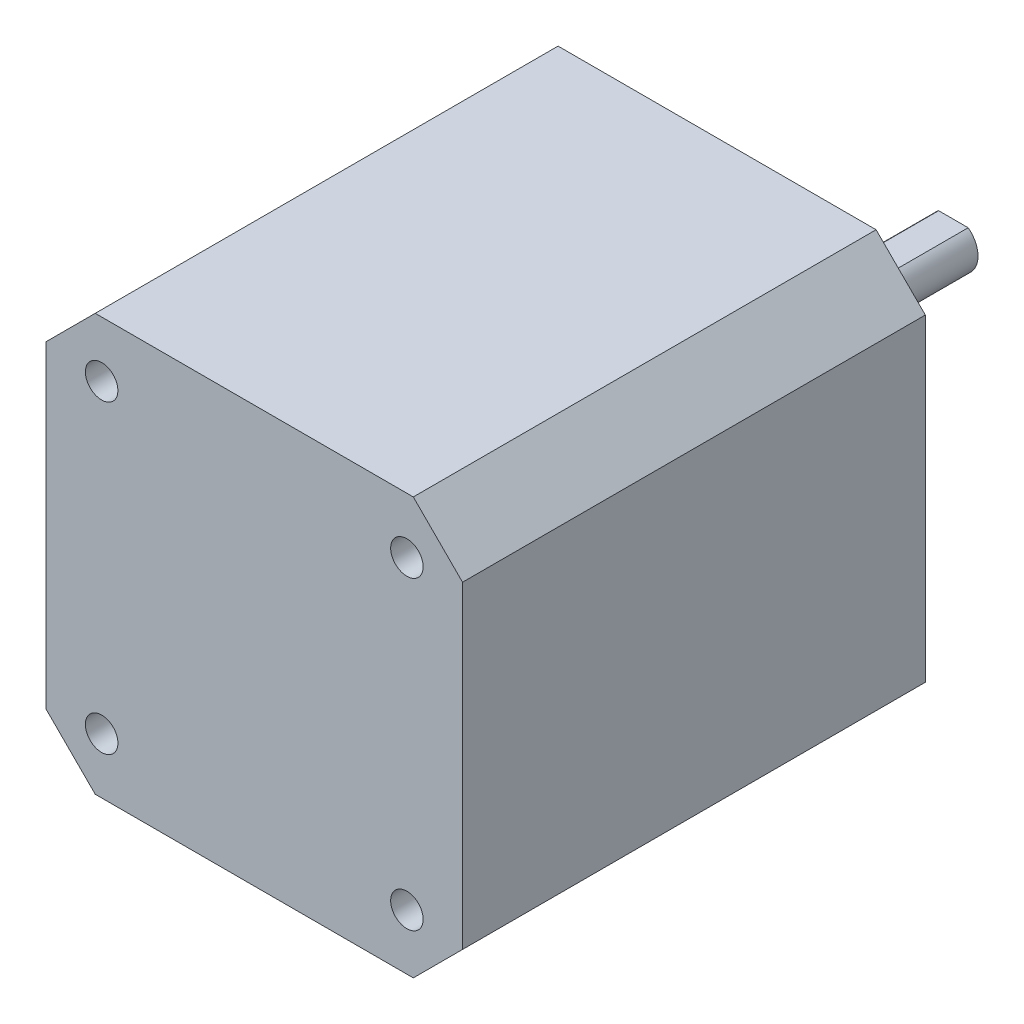
ISO-10303-21;
HEADER;
FILE_DESCRIPTION(('STEP AP214'),'2;1');
FILE_NAME('part.step','',(''),(''),'','','');
FILE_SCHEMA(('AUTOMOTIVE_DESIGN { 1 0 10303 214 1 1 1 1 }'));
ENDSEC;
DATA;
#1=APPLICATION_CONTEXT('core data for automotive mechanical design processes');
#2=APPLICATION_PROTOCOL_DEFINITION('international standard','automotive_design',2000,#1);
#3=PRODUCT_CONTEXT('',#1,'mechanical');
#4=PRODUCT('Part','Part','',(#3));
#5=PRODUCT_RELATED_PRODUCT_CATEGORY('part','',(#4));
#6=PRODUCT_DEFINITION_FORMATION('','',#4);
#7=PRODUCT_DEFINITION_CONTEXT('part definition',#1,'design');
#8=PRODUCT_DEFINITION('design','',#6,#7);
#9=PRODUCT_DEFINITION_SHAPE('','',#8);
#10=(LENGTH_UNIT() NAMED_UNIT(*) SI_UNIT(.MILLI.,.METRE.));
#11=(NAMED_UNIT(*) PLANE_ANGLE_UNIT() SI_UNIT($,.RADIAN.));
#12=(NAMED_UNIT(*) SI_UNIT($,.STERADIAN.) SOLID_ANGLE_UNIT());
#13=UNCERTAINTY_MEASURE_WITH_UNIT(LENGTH_MEASURE(1.E-05),#10,'distance_accuracy_value','');
#14=(GEOMETRIC_REPRESENTATION_CONTEXT(3) GLOBAL_UNCERTAINTY_ASSIGNED_CONTEXT((#13)) GLOBAL_UNIT_ASSIGNED_CONTEXT((#10,
#11,#12)) REPRESENTATION_CONTEXT('',''));
#15=CARTESIAN_POINT('',(0.,0.,0.));
#16=DIRECTION('',(0.,0.,1.));
#17=DIRECTION('',(1.,0.,0.));
#18=AXIS2_PLACEMENT_3D('',#15,#16,#17);
#19=CARTESIAN_POINT('',(0.,0.,-2.));
#20=DIRECTION('',(0.,0.,-1.));
#21=DIRECTION('',(-1.,0.,0.));
#22=AXIS2_PLACEMENT_3D('',#19,#20,#21);
#23=PLANE('',#22);
#24=CARTESIAN_POINT('',(0.,0.,-2.));
#25=DIRECTION('',(0.,0.,-1.));
#26=DIRECTION('',(-1.,0.,0.));
#27=AXIS2_PLACEMENT_3D('',#24,#25,#26);
#28=CIRCLE('',#27,11.);
#29=CARTESIAN_POINT('',(-11.,0.,-2.));
#30=VERTEX_POINT('',#29);
#31=EDGE_CURVE('E216',#30,#30,#28,.T.);
#32=ORIENTED_EDGE('',*,*,#31,.T.);
#33=EDGE_LOOP('',(#32));
#34=FACE_BOUND('',#33,.T.);
#35=DIRECTION('',(1.,0.,0.));
#36=VECTOR('',#35,1.);
#37=CARTESIAN_POINT('',(1.5,2.,-2.));
#38=LINE('',#37,#36);
#39=CARTESIAN_POINT('',(-1.5,2.,-2.));
#40=VERTEX_POINT('',#39);
#41=CARTESIAN_POINT('',(1.5,2.,-2.));
#42=VERTEX_POINT('',#41);
#43=EDGE_CURVE('E229',#40,#42,#38,.T.);
#44=ORIENTED_EDGE('',*,*,#43,.F.);
#45=CARTESIAN_POINT('',(0.,0.,-2.));
#46=DIRECTION('',(0.,0.,-1.));
#47=DIRECTION('',(-1.,0.,0.));
#48=AXIS2_PLACEMENT_3D('',#45,#46,#47);
#49=CIRCLE('',#48,2.5);
#50=EDGE_CURVE('E50',#42,#40,#49,.T.);
#51=ORIENTED_EDGE('',*,*,#50,.F.);
#52=EDGE_LOOP('',(#44,#51));
#53=FACE_BOUND('',#52,.T.);
#54=ADVANCED_FACE('F35',(#34,#53),#23,.T.);
#55=CARTESIAN_POINT('',(0.,0.,47.));
#56=DIRECTION('',(0.,0.,-1.));
#57=DIRECTION('',(-1.,0.,0.));
#58=AXIS2_PLACEMENT_3D('',#55,#56,#57);
#59=PLANE('',#58);
#60=DIRECTION('',(-1.,0.,0.));
#61=VECTOR('',#60,1.);
#62=CARTESIAN_POINT('',(-16.15,21.15,47.));
#63=LINE('',#62,#61);
#64=CARTESIAN_POINT('',(16.15,21.15,47.));
#65=VERTEX_POINT('',#64);
#66=CARTESIAN_POINT('',(-16.15,21.15,47.));
#67=VERTEX_POINT('',#66);
#68=EDGE_CURVE('E161',#65,#67,#63,.T.);
#69=ORIENTED_EDGE('',*,*,#68,.T.);
#70=DIRECTION('',(-0.707106781186548,-0.707106781186548,0.));
#71=VECTOR('',#70,1.);
#72=CARTESIAN_POINT('',(-21.15,16.15,47.));
#73=LINE('',#72,#71);
#74=CARTESIAN_POINT('',(-21.15,16.15,47.));
#75=VERTEX_POINT('',#74);
#76=EDGE_CURVE('E100',#67,#75,#73,.T.);
#77=ORIENTED_EDGE('',*,*,#76,.T.);
#78=DIRECTION('',(0.,-1.,0.));
#79=VECTOR('',#78,1.);
#80=CARTESIAN_POINT('',(-21.15,16.15,47.));
#81=LINE('',#80,#79);
#82=CARTESIAN_POINT('',(-21.15,-16.15,47.));
#83=VERTEX_POINT('',#82);
#84=EDGE_CURVE('E176',#75,#83,#81,.T.);
#85=ORIENTED_EDGE('',*,*,#84,.T.);
#86=DIRECTION('',(0.707106781186548,-0.707106781186548,0.));
#87=VECTOR('',#86,1.);
#88=CARTESIAN_POINT('',(-21.15,-16.15,47.));
#89=LINE('',#88,#87);
#90=CARTESIAN_POINT('',(-16.15,-21.15,47.));
#91=VERTEX_POINT('',#90);
#92=EDGE_CURVE('E189',#83,#91,#89,.T.);
#93=ORIENTED_EDGE('',*,*,#92,.T.);
#94=DIRECTION('',(1.,0.,0.));
#95=VECTOR('',#94,1.);
#96=CARTESIAN_POINT('',(-16.15,-21.15,47.));
#97=LINE('',#96,#95);
#98=CARTESIAN_POINT('',(16.15,-21.15,47.));
#99=VERTEX_POINT('',#98);
#100=EDGE_CURVE('E124',#91,#99,#97,.T.);
#101=ORIENTED_EDGE('',*,*,#100,.T.);
#102=DIRECTION('',(0.707106781186548,0.707106781186548,0.));
#103=VECTOR('',#102,1.);
#104=CARTESIAN_POINT('',(16.15,-21.15,47.));
#105=LINE('',#104,#103);
#106=CARTESIAN_POINT('',(21.15,-16.15,47.));
#107=VERTEX_POINT('',#106);
#108=EDGE_CURVE('E116',#99,#107,#105,.T.);
#109=ORIENTED_EDGE('',*,*,#108,.T.);
#110=DIRECTION('',(0.,1.,0.));
#111=VECTOR('',#110,1.);
#112=CARTESIAN_POINT('',(21.15,16.15,47.));
#113=LINE('',#112,#111);
#114=CARTESIAN_POINT('',(21.15,16.15,47.));
#115=VERTEX_POINT('',#114);
#116=EDGE_CURVE('E121',#107,#115,#113,.T.);
#117=ORIENTED_EDGE('',*,*,#116,.T.);
#118=DIRECTION('',(-0.707106781186548,0.707106781186548,0.));
#119=VECTOR('',#118,1.);
#120=CARTESIAN_POINT('',(16.15,21.15,47.));
#121=LINE('',#120,#119);
#122=EDGE_CURVE('E59',#115,#65,#121,.T.);
#123=ORIENTED_EDGE('',*,*,#122,.T.);
#124=EDGE_LOOP('',(#69,#77,#85,#93,#101,#109,#117,#123));
#125=FACE_BOUND('',#124,.T.);
#126=CARTESIAN_POINT('',(15.5,15.5,47.));
#127=DIRECTION('',(0.,0.,1.));
#128=DIRECTION('',(1.,0.,0.));
#129=AXIS2_PLACEMENT_3D('',#126,#127,#128);
#130=CIRCLE('',#129,1.65);
#131=CARTESIAN_POINT('',(17.15,15.5,47.));
#132=VERTEX_POINT('',#131);
#133=EDGE_CURVE('E149',#132,#132,#130,.T.);
#134=ORIENTED_EDGE('',*,*,#133,.F.);
#135=EDGE_LOOP('',(#134));
#136=FACE_BOUND('',#135,.T.);
#137=CARTESIAN_POINT('',(-15.5,15.5,47.));
#138=DIRECTION('',(0.,0.,1.));
#139=DIRECTION('',(-1.,0.,0.));
#140=AXIS2_PLACEMENT_3D('',#137,#138,#139);
#141=CIRCLE('',#140,1.65);
#142=CARTESIAN_POINT('',(-17.15,15.5,47.));
#143=VERTEX_POINT('',#142);
#144=EDGE_CURVE('E198',#143,#143,#141,.T.);
#145=ORIENTED_EDGE('',*,*,#144,.F.);
#146=EDGE_LOOP('',(#145));
#147=FACE_BOUND('',#146,.T.);
#148=CARTESIAN_POINT('',(15.5,-15.5,47.));
#149=DIRECTION('',(0.,0.,1.));
#150=DIRECTION('',(-1.,0.,0.));
#151=AXIS2_PLACEMENT_3D('',#148,#149,#150);
#152=CIRCLE('',#151,1.65);
#153=CARTESIAN_POINT('',(13.85,-15.5,47.));
#154=VERTEX_POINT('',#153);
#155=EDGE_CURVE('E204',#154,#154,#152,.T.);
#156=ORIENTED_EDGE('',*,*,#155,.F.);
#157=EDGE_LOOP('',(#156));
#158=FACE_BOUND('',#157,.T.);
#159=CARTESIAN_POINT('',(-15.5,-15.5,47.));
#160=DIRECTION('',(0.,0.,1.));
#161=DIRECTION('',(1.,0.,0.));
#162=AXIS2_PLACEMENT_3D('',#159,#160,#161);
#163=CIRCLE('',#162,1.65);
#164=CARTESIAN_POINT('',(-13.85,-15.5,47.));
#165=VERTEX_POINT('',#164);
#166=EDGE_CURVE('E210',#165,#165,#163,.T.);
#167=ORIENTED_EDGE('',*,*,#166,.F.);
#168=EDGE_LOOP('',(#167));
#169=FACE_BOUND('',#168,.T.);
#170=ADVANCED_FACE('F118',(#125,#136,#147,#158,#169),#59,.F.);
#171=CARTESIAN_POINT('',(0.,0.,0.));
#172=DIRECTION('',(0.,0.,-1.));
#173=DIRECTION('',(-1.,0.,0.));
#174=AXIS2_PLACEMENT_3D('',#171,#172,#173);
#175=PLANE('',#174);
#176=CARTESIAN_POINT('',(0.,0.,0.));
#177=DIRECTION('',(0.,0.,-1.));
#178=DIRECTION('',(-1.,0.,0.));
#179=AXIS2_PLACEMENT_3D('',#176,#177,#178);
#180=CIRCLE('',#179,11.);
#181=CARTESIAN_POINT('',(-11.,0.,0.));
#182=VERTEX_POINT('',#181);
#183=EDGE_CURVE('E219',#182,#182,#180,.T.);
#184=ORIENTED_EDGE('',*,*,#183,.F.);
#185=EDGE_LOOP('',(#184));
#186=FACE_BOUND('',#185,.T.);
#187=CARTESIAN_POINT('',(15.5,-15.5,0.));
#188=DIRECTION('',(0.,0.,1.));
#189=DIRECTION('',(-1.,0.,0.));
#190=AXIS2_PLACEMENT_3D('',#187,#188,#189);
#191=CIRCLE('',#190,1.65);
#192=CARTESIAN_POINT('',(13.85,-15.5,0.));
#193=VERTEX_POINT('',#192);
#194=EDGE_CURVE('E207',#193,#193,#191,.T.);
#195=ORIENTED_EDGE('',*,*,#194,.T.);
#196=EDGE_LOOP('',(#195));
#197=FACE_BOUND('',#196,.T.);
#198=CARTESIAN_POINT('',(15.5,15.5,0.));
#199=DIRECTION('',(0.,0.,1.));
#200=DIRECTION('',(1.,0.,0.));
#201=AXIS2_PLACEMENT_3D('',#198,#199,#200);
#202=CIRCLE('',#201,1.65);
#203=CARTESIAN_POINT('',(17.15,15.5,0.));
#204=VERTEX_POINT('',#203);
#205=EDGE_CURVE('E195',#204,#204,#202,.T.);
#206=ORIENTED_EDGE('',*,*,#205,.T.);
#207=EDGE_LOOP('',(#206));
#208=FACE_BOUND('',#207,.T.);
#209=DIRECTION('',(-1.,0.,0.));
#210=VECTOR('',#209,1.);
#211=CARTESIAN_POINT('',(-16.15,21.15,0.));
#212=LINE('',#211,#210);
#213=CARTESIAN_POINT('',(16.15,21.15,0.));
#214=VERTEX_POINT('',#213);
#215=CARTESIAN_POINT('',(-16.15,21.15,0.));
#216=VERTEX_POINT('',#215);
#217=EDGE_CURVE('E145',#214,#216,#212,.T.);
#218=ORIENTED_EDGE('',*,*,#217,.F.);
#219=DIRECTION('',(-0.707106781186548,0.707106781186548,0.));
#220=VECTOR('',#219,1.);
#221=CARTESIAN_POINT('',(16.15,21.15,0.));
#222=LINE('',#221,#220);
#223=CARTESIAN_POINT('',(21.15,16.15,0.));
#224=VERTEX_POINT('',#223);
#225=EDGE_CURVE('E92',#224,#214,#222,.T.);
#226=ORIENTED_EDGE('',*,*,#225,.F.);
#227=DIRECTION('',(0.,1.,0.));
#228=VECTOR('',#227,1.);
#229=CARTESIAN_POINT('',(21.15,16.15,0.));
#230=LINE('',#229,#228);
#231=CARTESIAN_POINT('',(21.15,-16.15,0.));
#232=VERTEX_POINT('',#231);
#233=EDGE_CURVE('E158',#232,#224,#230,.T.);
#234=ORIENTED_EDGE('',*,*,#233,.F.);
#235=DIRECTION('',(0.707106781186548,0.707106781186548,0.));
#236=VECTOR('',#235,1.);
#237=CARTESIAN_POINT('',(16.15,-21.15,0.));
#238=LINE('',#237,#236);
#239=CARTESIAN_POINT('',(16.15,-21.15,0.));
#240=VERTEX_POINT('',#239);
#241=EDGE_CURVE('E133',#240,#232,#238,.T.);
#242=ORIENTED_EDGE('',*,*,#241,.F.);
#243=DIRECTION('',(1.,0.,0.));
#244=VECTOR('',#243,1.);
#245=CARTESIAN_POINT('',(-16.15,-21.15,0.));
#246=LINE('',#245,#244);
#247=CARTESIAN_POINT('',(-16.15,-21.15,0.));
#248=VERTEX_POINT('',#247);
#249=EDGE_CURVE('E155',#248,#240,#246,.T.);
#250=ORIENTED_EDGE('',*,*,#249,.F.);
#251=DIRECTION('',(0.707106781186548,-0.707106781186548,0.));
#252=VECTOR('',#251,1.);
#253=CARTESIAN_POINT('',(-21.15,-16.15,0.));
#254=LINE('',#253,#252);
#255=CARTESIAN_POINT('',(-21.15,-16.15,0.));
#256=VERTEX_POINT('',#255);
#257=EDGE_CURVE('E153',#256,#248,#254,.T.);
#258=ORIENTED_EDGE('',*,*,#257,.F.);
#259=DIRECTION('',(0.,-1.,0.));
#260=VECTOR('',#259,1.);
#261=CARTESIAN_POINT('',(-21.15,16.15,0.));
#262=LINE('',#261,#260);
#263=CARTESIAN_POINT('',(-21.15,16.15,0.));
#264=VERTEX_POINT('',#263);
#265=EDGE_CURVE('E151',#264,#256,#262,.T.);
#266=ORIENTED_EDGE('',*,*,#265,.F.);
#267=DIRECTION('',(-0.707106781186548,-0.707106781186548,0.));
#268=VECTOR('',#267,1.);
#269=CARTESIAN_POINT('',(-21.15,16.15,0.));
#270=LINE('',#269,#268);
#271=EDGE_CURVE('E148',#216,#264,#270,.T.);
#272=ORIENTED_EDGE('',*,*,#271,.F.);
#273=EDGE_LOOP('',(#218,#226,#234,#242,#250,#258,#266,#272));
#274=FACE_BOUND('',#273,.T.);
#275=CARTESIAN_POINT('',(-15.5,15.5,0.));
#276=DIRECTION('',(0.,0.,1.));
#277=DIRECTION('',(-1.,0.,0.));
#278=AXIS2_PLACEMENT_3D('',#275,#276,#277);
#279=CIRCLE('',#278,1.65);
#280=CARTESIAN_POINT('',(-17.15,15.5,0.));
#281=VERTEX_POINT('',#280);
#282=EDGE_CURVE('E201',#281,#281,#279,.T.);
#283=ORIENTED_EDGE('',*,*,#282,.T.);
#284=EDGE_LOOP('',(#283));
#285=FACE_BOUND('',#284,.T.);
#286=CARTESIAN_POINT('',(-15.5,-15.5,0.));
#287=DIRECTION('',(0.,0.,1.));
#288=DIRECTION('',(1.,0.,0.));
#289=AXIS2_PLACEMENT_3D('',#286,#287,#288);
#290=CIRCLE('',#289,1.65);
#291=CARTESIAN_POINT('',(-13.85,-15.5,0.));
#292=VERTEX_POINT('',#291);
#293=EDGE_CURVE('E213',#292,#292,#290,.T.);
#294=ORIENTED_EDGE('',*,*,#293,.T.);
#295=EDGE_LOOP('',(#294));
#296=FACE_BOUND('',#295,.T.);
#297=ADVANCED_FACE('F180',(#186,#197,#208,#274,#285,#296),#175,.T.);
#298=CARTESIAN_POINT('',(-16.15,21.15,47.));
#299=DIRECTION('',(0.,-1.,0.));
#300=DIRECTION('',(0.,0.,-1.));
#301=AXIS2_PLACEMENT_3D('',#298,#299,#300);
#302=PLANE('',#301);
#303=ORIENTED_EDGE('',*,*,#217,.T.);
#304=DIRECTION('',(0.,0.,-1.));
#305=VECTOR('',#304,1.);
#306=CARTESIAN_POINT('',(-16.15,21.15,47.));
#307=LINE('',#306,#305);
#308=EDGE_CURVE('E11',#67,#216,#307,.T.);
#309=ORIENTED_EDGE('',*,*,#308,.F.);
#310=ORIENTED_EDGE('',*,*,#68,.F.);
#311=DIRECTION('',(0.,0.,-1.));
#312=VECTOR('',#311,1.);
#313=CARTESIAN_POINT('',(16.15,21.15,47.));
#314=LINE('',#313,#312);
#315=EDGE_CURVE('E141',#65,#214,#314,.T.);
#316=ORIENTED_EDGE('',*,*,#315,.T.);
#317=EDGE_LOOP('',(#303,#309,#310,#316));
#318=FACE_BOUND('',#317,.T.);
#319=ADVANCED_FACE('F37',(#318),#302,.F.);
#320=CARTESIAN_POINT('',(-21.15,16.15,47.));
#321=DIRECTION('',(0.707106781186547,-0.707106781186547,0.));
#322=DIRECTION('',(0.707106781186548,0.707106781186548,0.));
#323=AXIS2_PLACEMENT_3D('',#320,#321,#322);
#324=PLANE('',#323);
#325=ORIENTED_EDGE('',*,*,#271,.T.);
#326=DIRECTION('',(0.,0.,-1.));
#327=VECTOR('',#326,1.);
#328=CARTESIAN_POINT('',(-21.15,16.15,47.));
#329=LINE('',#328,#327);
#330=EDGE_CURVE('E43',#75,#264,#329,.T.);
#331=ORIENTED_EDGE('',*,*,#330,.F.);
#332=ORIENTED_EDGE('',*,*,#76,.F.);
#333=ORIENTED_EDGE('',*,*,#308,.T.);
#334=EDGE_LOOP('',(#325,#331,#332,#333));
#335=FACE_BOUND('',#334,.T.);
#336=ADVANCED_FACE('F294',(#335),#324,.F.);
#337=CARTESIAN_POINT('',(-21.15,16.15,47.));
#338=DIRECTION('',(1.,0.,0.));
#339=DIRECTION('',(0.,0.,-1.));
#340=AXIS2_PLACEMENT_3D('',#337,#338,#339);
#341=PLANE('',#340);
#342=ORIENTED_EDGE('',*,*,#265,.T.);
#343=DIRECTION('',(0.,0.,-1.));
#344=VECTOR('',#343,1.);
#345=CARTESIAN_POINT('',(-21.15,-16.15,47.));
#346=LINE('',#345,#344);
#347=EDGE_CURVE('E168',#83,#256,#346,.T.);
#348=ORIENTED_EDGE('',*,*,#347,.F.);
#349=ORIENTED_EDGE('',*,*,#84,.F.);
#350=ORIENTED_EDGE('',*,*,#330,.T.);
#351=EDGE_LOOP('',(#342,#348,#349,#350));
#352=FACE_BOUND('',#351,.T.);
#353=ADVANCED_FACE('F174',(#352),#341,.F.);
#354=CARTESIAN_POINT('',(-21.15,-16.15,47.));
#355=DIRECTION('',(0.707106781186547,0.707106781186547,0.));
#356=DIRECTION('',(-0.707106781186548,0.707106781186548,0.));
#357=AXIS2_PLACEMENT_3D('',#354,#355,#356);
#358=PLANE('',#357);
#359=ORIENTED_EDGE('',*,*,#257,.T.);
#360=DIRECTION('',(0.,0.,-1.));
#361=VECTOR('',#360,1.);
#362=CARTESIAN_POINT('',(-16.15,-21.15,47.));
#363=LINE('',#362,#361);
#364=EDGE_CURVE('E165',#91,#248,#363,.T.);
#365=ORIENTED_EDGE('',*,*,#364,.F.);
#366=ORIENTED_EDGE('',*,*,#92,.F.);
#367=ORIENTED_EDGE('',*,*,#347,.T.);
#368=EDGE_LOOP('',(#359,#365,#366,#367));
#369=FACE_BOUND('',#368,.T.);
#370=ADVANCED_FACE('F185',(#369),#358,.F.);
#371=CARTESIAN_POINT('',(-16.15,-21.15,47.));
#372=DIRECTION('',(0.,1.,0.));
#373=DIRECTION('',(0.,0.,1.));
#374=AXIS2_PLACEMENT_3D('',#371,#372,#373);
#375=PLANE('',#374);
#376=ORIENTED_EDGE('',*,*,#249,.T.);
#377=DIRECTION('',(0.,0.,-1.));
#378=VECTOR('',#377,1.);
#379=CARTESIAN_POINT('',(16.15,-21.15,47.));
#380=LINE('',#379,#378);
#381=EDGE_CURVE('E136',#99,#240,#380,.T.);
#382=ORIENTED_EDGE('',*,*,#381,.F.);
#383=ORIENTED_EDGE('',*,*,#100,.F.);
#384=ORIENTED_EDGE('',*,*,#364,.T.);
#385=EDGE_LOOP('',(#376,#382,#383,#384));
#386=FACE_BOUND('',#385,.T.);
#387=ADVANCED_FACE('F188',(#386),#375,.F.);
#388=CARTESIAN_POINT('',(16.15,-21.15,47.));
#389=DIRECTION('',(-0.707106781186547,0.707106781186547,0.));
#390=DIRECTION('',(-0.707106781186548,-0.707106781186548,0.));
#391=AXIS2_PLACEMENT_3D('',#388,#389,#390);
#392=PLANE('',#391);
#393=ORIENTED_EDGE('',*,*,#241,.T.);
#394=DIRECTION('',(0.,0.,-1.));
#395=VECTOR('',#394,1.);
#396=CARTESIAN_POINT('',(21.15,-16.15,47.));
#397=LINE('',#396,#395);
#398=EDGE_CURVE('E130',#107,#232,#397,.T.);
#399=ORIENTED_EDGE('',*,*,#398,.F.);
#400=ORIENTED_EDGE('',*,*,#108,.F.);
#401=ORIENTED_EDGE('',*,*,#381,.T.);
#402=EDGE_LOOP('',(#393,#399,#400,#401));
#403=FACE_BOUND('',#402,.T.);
#404=ADVANCED_FACE('F131',(#403),#392,.F.);
#405=CARTESIAN_POINT('',(21.15,16.15,47.));
#406=DIRECTION('',(-1.,0.,0.));
#407=DIRECTION('',(0.,-1.,0.));
#408=AXIS2_PLACEMENT_3D('',#405,#406,#407);
#409=PLANE('',#408);
#410=ORIENTED_EDGE('',*,*,#233,.T.);
#411=DIRECTION('',(0.,0.,-1.));
#412=VECTOR('',#411,1.);
#413=CARTESIAN_POINT('',(21.15,16.15,47.));
#414=LINE('',#413,#412);
#415=EDGE_CURVE('E137',#115,#224,#414,.T.);
#416=ORIENTED_EDGE('',*,*,#415,.F.);
#417=ORIENTED_EDGE('',*,*,#116,.F.);
#418=ORIENTED_EDGE('',*,*,#398,.T.);
#419=EDGE_LOOP('',(#410,#416,#417,#418));
#420=FACE_BOUND('',#419,.T.);
#421=ADVANCED_FACE('F139',(#420),#409,.F.);
#422=CARTESIAN_POINT('',(16.15,21.15,47.));
#423=DIRECTION('',(-0.707106781186547,-0.707106781186547,0.));
#424=DIRECTION('',(0.707106781186548,-0.707106781186548,0.));
#425=AXIS2_PLACEMENT_3D('',#422,#423,#424);
#426=PLANE('',#425);
#427=ORIENTED_EDGE('',*,*,#225,.T.);
#428=ORIENTED_EDGE('',*,*,#315,.F.);
#429=ORIENTED_EDGE('',*,*,#122,.F.);
#430=ORIENTED_EDGE('',*,*,#415,.T.);
#431=EDGE_LOOP('',(#427,#428,#429,#430));
#432=FACE_BOUND('',#431,.T.);
#433=ADVANCED_FACE('F277',(#432),#426,.F.);
#434=CARTESIAN_POINT('',(15.5,15.5,47.));
#435=DIRECTION('',(0.,0.,-1.));
#436=DIRECTION('',(-1.,0.,0.));
#437=AXIS2_PLACEMENT_3D('',#434,#435,#436);
#438=CYLINDRICAL_SURFACE('',#437,1.65);
#439=ORIENTED_EDGE('',*,*,#133,.T.);
#440=EDGE_LOOP('',(#439));
#441=FACE_BOUND('',#440,.T.);
#442=ORIENTED_EDGE('',*,*,#205,.F.);
#443=EDGE_LOOP('',(#442));
#444=FACE_BOUND('',#443,.T.);
#445=ADVANCED_FACE('F274',(#441,#444),#438,.F.);
#446=CARTESIAN_POINT('',(-15.5,15.5,47.));
#447=DIRECTION('',(0.,0.,-1.));
#448=DIRECTION('',(-1.,0.,0.));
#449=AXIS2_PLACEMENT_3D('',#446,#447,#448);
#450=CYLINDRICAL_SURFACE('',#449,1.65);
#451=ORIENTED_EDGE('',*,*,#144,.T.);
#452=EDGE_LOOP('',(#451));
#453=FACE_BOUND('',#452,.T.);
#454=ORIENTED_EDGE('',*,*,#282,.F.);
#455=EDGE_LOOP('',(#454));
#456=FACE_BOUND('',#455,.T.);
#457=ADVANCED_FACE('F270',(#453,#456),#450,.F.);
#458=CARTESIAN_POINT('',(15.5,-15.5,47.));
#459=DIRECTION('',(0.,0.,-1.));
#460=DIRECTION('',(-1.,0.,0.));
#461=AXIS2_PLACEMENT_3D('',#458,#459,#460);
#462=CYLINDRICAL_SURFACE('',#461,1.65);
#463=ORIENTED_EDGE('',*,*,#155,.T.);
#464=EDGE_LOOP('',(#463));
#465=FACE_BOUND('',#464,.T.);
#466=ORIENTED_EDGE('',*,*,#194,.F.);
#467=EDGE_LOOP('',(#466));
#468=FACE_BOUND('',#467,.T.);
#469=ADVANCED_FACE('F266',(#465,#468),#462,.F.);
#470=CARTESIAN_POINT('',(-15.5,-15.5,47.));
#471=DIRECTION('',(0.,0.,-1.));
#472=DIRECTION('',(-1.,0.,0.));
#473=AXIS2_PLACEMENT_3D('',#470,#471,#472);
#474=CYLINDRICAL_SURFACE('',#473,1.65);
#475=ORIENTED_EDGE('',*,*,#166,.T.);
#476=EDGE_LOOP('',(#475));
#477=FACE_BOUND('',#476,.T.);
#478=ORIENTED_EDGE('',*,*,#293,.F.);
#479=EDGE_LOOP('',(#478));
#480=FACE_BOUND('',#479,.T.);
#481=ADVANCED_FACE('F262',(#477,#480),#474,.F.);
#482=CARTESIAN_POINT('',(0.,0.,-2.));
#483=DIRECTION('',(0.,0.,1.));
#484=DIRECTION('',(1.,0.,0.));
#485=AXIS2_PLACEMENT_3D('',#482,#483,#484);
#486=CYLINDRICAL_SURFACE('',#485,11.);
#487=ORIENTED_EDGE('',*,*,#31,.F.);
#488=EDGE_LOOP('',(#487));
#489=FACE_BOUND('',#488,.T.);
#490=ORIENTED_EDGE('',*,*,#183,.T.);
#491=EDGE_LOOP('',(#490));
#492=FACE_BOUND('',#491,.T.);
#493=ADVANCED_FACE('F259',(#489,#492),#486,.T.);
#494=CARTESIAN_POINT('',(0.,0.,-24.));
#495=DIRECTION('',(0.,0.,1.));
#496=DIRECTION('',(1.,0.,0.));
#497=AXIS2_PLACEMENT_3D('',#494,#495,#496);
#498=CYLINDRICAL_SURFACE('',#497,2.5);
#499=ORIENTED_EDGE('',*,*,#50,.T.);
#500=DIRECTION('',(0.,0.,1.));
#501=VECTOR('',#500,1.);
#502=CARTESIAN_POINT('',(-1.5,2.,-24.));
#503=LINE('',#502,#501);
#504=CARTESIAN_POINT('',(-1.5,2.,-24.));
#505=VERTEX_POINT('',#504);
#506=EDGE_CURVE('E222',#505,#40,#503,.T.);
#507=ORIENTED_EDGE('',*,*,#506,.F.);
#508=CARTESIAN_POINT('',(0.,0.,-24.));
#509=DIRECTION('',(0.,0.,-1.));
#510=DIRECTION('',(-1.,0.,0.));
#511=AXIS2_PLACEMENT_3D('',#508,#509,#510);
#512=CIRCLE('',#511,2.5);
#513=CARTESIAN_POINT('',(1.5,2.,-24.));
#514=VERTEX_POINT('',#513);
#515=EDGE_CURVE('E232',#514,#505,#512,.T.);
#516=ORIENTED_EDGE('',*,*,#515,.F.);
#517=DIRECTION('',(0.,0.,1.));
#518=VECTOR('',#517,1.);
#519=CARTESIAN_POINT('',(1.5,2.,-24.));
#520=LINE('',#519,#518);
#521=EDGE_CURVE('E226',#514,#42,#520,.T.);
#522=ORIENTED_EDGE('',*,*,#521,.T.);
#523=EDGE_LOOP('',(#499,#507,#516,#522));
#524=FACE_BOUND('',#523,.T.);
#525=ADVANCED_FACE('F244',(#524),#498,.T.);
#526=CARTESIAN_POINT('',(1.5,2.,-24.));
#527=DIRECTION('',(0.,-1.,0.));
#528=DIRECTION('',(0.,0.,-1.));
#529=AXIS2_PLACEMENT_3D('',#526,#527,#528);
#530=PLANE('',#529);
#531=ORIENTED_EDGE('',*,*,#43,.T.);
#532=ORIENTED_EDGE('',*,*,#521,.F.);
#533=DIRECTION('',(1.,0.,0.));
#534=VECTOR('',#533,1.);
#535=CARTESIAN_POINT('',(1.5,2.,-24.));
#536=LINE('',#535,#534);
#537=EDGE_CURVE('E228',#505,#514,#536,.T.);
#538=ORIENTED_EDGE('',*,*,#537,.F.);
#539=ORIENTED_EDGE('',*,*,#506,.T.);
#540=EDGE_LOOP('',(#531,#532,#538,#539));
#541=FACE_BOUND('',#540,.T.);
#542=ADVANCED_FACE('F247',(#541),#530,.F.);
#543=CARTESIAN_POINT('',(0.,0.,-24.));
#544=DIRECTION('',(0.,0.,-1.));
#545=DIRECTION('',(-1.,0.,0.));
#546=AXIS2_PLACEMENT_3D('',#543,#544,#545);
#547=PLANE('',#546);
#548=ORIENTED_EDGE('',*,*,#515,.T.);
#549=ORIENTED_EDGE('',*,*,#537,.T.);
#550=EDGE_LOOP('',(#548,#549));
#551=FACE_BOUND('',#550,.T.);
#552=ADVANCED_FACE('F240',(#551),#547,.T.);
#553=CLOSED_SHELL('',(#54,#170,#297,#319,#336,#353,#370,#387,#404,#421,#433,#445,#457,#469,#481,
#493,#525,#542,#552));
#554=MANIFOLD_SOLID_BREP('B2',#553);
#555=ADVANCED_BREP_SHAPE_REPRESENTATION('',(#18,#554),#14);
#556=SHAPE_DEFINITION_REPRESENTATION(#9,#555);
ENDSEC;
END-ISO-10303-21;
